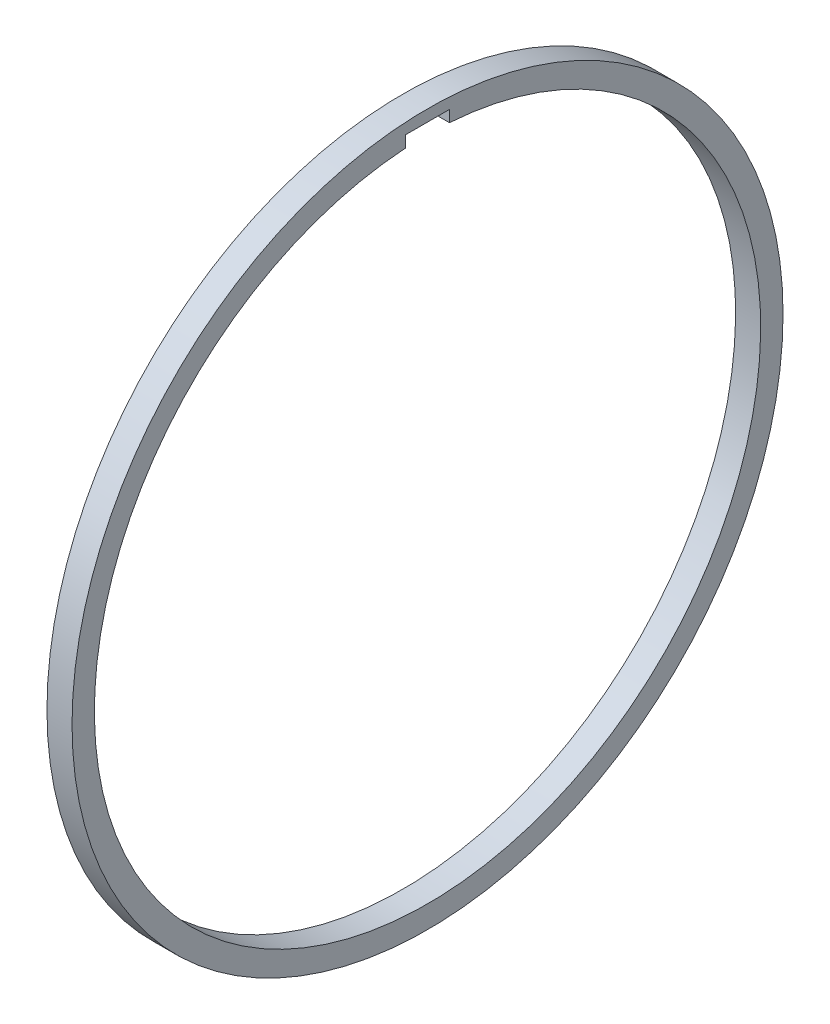
ISO-10303-21;
HEADER;
FILE_DESCRIPTION(('STEP AP214'),'2;1');
FILE_NAME('part.step','',(''),(''),'','','');
FILE_SCHEMA(('AUTOMOTIVE_DESIGN { 1 0 10303 214 1 1 1 1 }'));
ENDSEC;
DATA;
#1=APPLICATION_CONTEXT('core data for automotive mechanical design processes');
#2=APPLICATION_PROTOCOL_DEFINITION('international standard','automotive_design',2000,#1);
#3=PRODUCT_CONTEXT('',#1,'mechanical');
#4=PRODUCT('Part','Part','',(#3));
#5=PRODUCT_RELATED_PRODUCT_CATEGORY('part','',(#4));
#6=PRODUCT_DEFINITION_FORMATION('','',#4);
#7=PRODUCT_DEFINITION_CONTEXT('part definition',#1,'design');
#8=PRODUCT_DEFINITION('design','',#6,#7);
#9=PRODUCT_DEFINITION_SHAPE('','',#8);
#10=(LENGTH_UNIT() NAMED_UNIT(*) SI_UNIT(.MILLI.,.METRE.));
#11=(NAMED_UNIT(*) PLANE_ANGLE_UNIT() SI_UNIT($,.RADIAN.));
#12=(NAMED_UNIT(*) SI_UNIT($,.STERADIAN.) SOLID_ANGLE_UNIT());
#13=UNCERTAINTY_MEASURE_WITH_UNIT(LENGTH_MEASURE(1.E-05),#10,'distance_accuracy_value','');
#14=(GEOMETRIC_REPRESENTATION_CONTEXT(3) GLOBAL_UNCERTAINTY_ASSIGNED_CONTEXT((#13)) GLOBAL_UNIT_ASSIGNED_CONTEXT((#10,
#11,#12)) REPRESENTATION_CONTEXT('',''));
#15=CARTESIAN_POINT('',(0.,0.,0.));
#16=DIRECTION('',(0.,0.,1.));
#17=DIRECTION('',(1.,0.,0.));
#18=AXIS2_PLACEMENT_3D('',#15,#16,#17);
#19=CARTESIAN_POINT('',(-12.,0.,0.));
#20=DIRECTION('',(1.,0.,0.));
#21=DIRECTION('',(0.,0.,-1.));
#22=AXIS2_PLACEMENT_3D('',#19,#20,#21);
#23=CYLINDRICAL_SURFACE('',#22,170.2);
#24=CARTESIAN_POINT('',(-12.,0.,0.));
#25=DIRECTION('',(1.,0.,0.));
#26=DIRECTION('',(0.,0.,-1.));
#27=AXIS2_PLACEMENT_3D('',#24,#25,#26);
#28=CIRCLE('',#27,170.2);
#29=CARTESIAN_POINT('',(-12.,0.,-170.2));
#30=VERTEX_POINT('',#29);
#31=EDGE_CURVE('E11',#30,#30,#28,.T.);
#32=ORIENTED_EDGE('',*,*,#31,.T.);
#33=EDGE_LOOP('',(#32));
#34=FACE_BOUND('',#33,.T.);
#35=CARTESIAN_POINT('',(0.,0.,0.));
#36=DIRECTION('',(1.,0.,0.));
#37=DIRECTION('',(0.,0.,-1.));
#38=AXIS2_PLACEMENT_3D('',#35,#36,#37);
#39=CIRCLE('',#38,170.2);
#40=CARTESIAN_POINT('',(0.,0.,-170.2));
#41=VERTEX_POINT('',#40);
#42=EDGE_CURVE('E41',#41,#41,#39,.T.);
#43=ORIENTED_EDGE('',*,*,#42,.F.);
#44=EDGE_LOOP('',(#43));
#45=FACE_BOUND('',#44,.T.);
#46=ADVANCED_FACE('F38',(#34,#45),#23,.T.);
#47=CARTESIAN_POINT('',(-12.,0.,0.));
#48=DIRECTION('',(1.,0.,0.));
#49=DIRECTION('',(0.,0.,-1.));
#50=AXIS2_PLACEMENT_3D('',#47,#48,#49);
#51=PLANE('',#50);
#52=CARTESIAN_POINT('',(-12.,0.,0.));
#53=DIRECTION('',(1.,0.,0.));
#54=DIRECTION('',(0.,0.,-1.));
#55=AXIS2_PLACEMENT_3D('',#52,#53,#54);
#56=CIRCLE('',#55,159.5);
#57=CARTESIAN_POINT('',(-12.,159.154013458662,10.5));
#58=VERTEX_POINT('',#57);
#59=CARTESIAN_POINT('',(-12.,159.154013458662,-10.5));
#60=VERTEX_POINT('',#59);
#61=EDGE_CURVE('E123',#58,#60,#56,.T.);
#62=ORIENTED_EDGE('',*,*,#61,.T.);
#63=DIRECTION('',(0.,1.,0.));
#64=VECTOR('',#63,1.);
#65=CARTESIAN_POINT('',(-12.,159.154013458662,-10.5));
#66=LINE('',#65,#64);
#67=CARTESIAN_POINT('',(-12.,164.654013458662,-10.5));
#68=VERTEX_POINT('',#67);
#69=EDGE_CURVE('E62',#60,#68,#66,.T.);
#70=ORIENTED_EDGE('',*,*,#69,.T.);
#71=DIRECTION('',(0.,0.,1.));
#72=VECTOR('',#71,1.);
#73=CARTESIAN_POINT('',(-12.,164.654013458662,10.5));
#74=LINE('',#73,#72);
#75=CARTESIAN_POINT('',(-12.,164.654013458662,10.5));
#76=VERTEX_POINT('',#75);
#77=EDGE_CURVE('E87',#68,#76,#74,.T.);
#78=ORIENTED_EDGE('',*,*,#77,.T.);
#79=DIRECTION('',(0.,-1.,0.));
#80=VECTOR('',#79,1.);
#81=CARTESIAN_POINT('',(-12.,159.154013458662,10.5));
#82=LINE('',#81,#80);
#83=EDGE_CURVE('E94',#76,#58,#82,.T.);
#84=ORIENTED_EDGE('',*,*,#83,.T.);
#85=EDGE_LOOP('',(#62,#70,#78,#84));
#86=FACE_BOUND('',#85,.T.);
#87=ORIENTED_EDGE('',*,*,#31,.F.);
#88=EDGE_LOOP('',(#87));
#89=FACE_BOUND('',#88,.T.);
#90=ADVANCED_FACE('F101',(#86,#89),#51,.F.);
#91=CARTESIAN_POINT('',(0.,0.,0.));
#92=DIRECTION('',(1.,0.,0.));
#93=DIRECTION('',(0.,0.,-1.));
#94=AXIS2_PLACEMENT_3D('',#91,#92,#93);
#95=PLANE('',#94);
#96=DIRECTION('',(0.,1.,0.));
#97=VECTOR('',#96,1.);
#98=CARTESIAN_POINT('',(0.,159.154013458662,-10.5));
#99=LINE('',#98,#97);
#100=CARTESIAN_POINT('',(0.,159.154013458662,-10.5));
#101=VERTEX_POINT('',#100);
#102=CARTESIAN_POINT('',(0.,164.654013458662,-10.5));
#103=VERTEX_POINT('',#102);
#104=EDGE_CURVE('E109',#101,#103,#99,.T.);
#105=ORIENTED_EDGE('',*,*,#104,.F.);
#106=CARTESIAN_POINT('',(0.,0.,0.));
#107=DIRECTION('',(1.,0.,0.));
#108=DIRECTION('',(0.,0.,-1.));
#109=AXIS2_PLACEMENT_3D('',#106,#107,#108);
#110=CIRCLE('',#109,159.5);
#111=CARTESIAN_POINT('',(0.,159.154013458662,10.5));
#112=VERTEX_POINT('',#111);
#113=EDGE_CURVE('E118',#112,#101,#110,.T.);
#114=ORIENTED_EDGE('',*,*,#113,.F.);
#115=DIRECTION('',(0.,-1.,0.));
#116=VECTOR('',#115,1.);
#117=CARTESIAN_POINT('',(0.,159.154013458662,10.5));
#118=LINE('',#117,#116);
#119=CARTESIAN_POINT('',(0.,164.654013458662,10.5));
#120=VERTEX_POINT('',#119);
#121=EDGE_CURVE('E53',#120,#112,#118,.T.);
#122=ORIENTED_EDGE('',*,*,#121,.F.);
#123=DIRECTION('',(0.,0.,1.));
#124=VECTOR('',#123,1.);
#125=CARTESIAN_POINT('',(0.,164.654013458662,10.5));
#126=LINE('',#125,#124);
#127=EDGE_CURVE('E89',#103,#120,#126,.T.);
#128=ORIENTED_EDGE('',*,*,#127,.F.);
#129=EDGE_LOOP('',(#105,#114,#122,#128));
#130=FACE_BOUND('',#129,.T.);
#131=ORIENTED_EDGE('',*,*,#42,.T.);
#132=EDGE_LOOP('',(#131));
#133=FACE_BOUND('',#132,.T.);
#134=ADVANCED_FACE('F134',(#130,#133),#95,.T.);
#135=CARTESIAN_POINT('',(-12.,0.,0.));
#136=DIRECTION('',(1.,0.,0.));
#137=DIRECTION('',(0.,0.,-1.));
#138=AXIS2_PLACEMENT_3D('',#135,#136,#137);
#139=CYLINDRICAL_SURFACE('',#138,159.5);
#140=ORIENTED_EDGE('',*,*,#113,.T.);
#141=DIRECTION('',(1.,0.,0.));
#142=VECTOR('',#141,1.);
#143=CARTESIAN_POINT('',(-12.,159.154013458662,-10.5));
#144=LINE('',#143,#142);
#145=EDGE_CURVE('E75',#60,#101,#144,.T.);
#146=ORIENTED_EDGE('',*,*,#145,.F.);
#147=ORIENTED_EDGE('',*,*,#61,.F.);
#148=DIRECTION('',(1.,0.,0.));
#149=VECTOR('',#148,1.);
#150=CARTESIAN_POINT('',(-12.,159.154013458662,10.5));
#151=LINE('',#150,#149);
#152=EDGE_CURVE('E91',#58,#112,#151,.T.);
#153=ORIENTED_EDGE('',*,*,#152,.T.);
#154=EDGE_LOOP('',(#140,#146,#147,#153));
#155=FACE_BOUND('',#154,.T.);
#156=ADVANCED_FACE('F132',(#155),#139,.F.);
#157=CARTESIAN_POINT('',(-12.,159.154013458662,-10.5));
#158=DIRECTION('',(0.,0.,-1.));
#159=DIRECTION('',(-1.,0.,0.));
#160=AXIS2_PLACEMENT_3D('',#157,#158,#159);
#161=PLANE('',#160);
#162=ORIENTED_EDGE('',*,*,#104,.T.);
#163=DIRECTION('',(1.,0.,0.));
#164=VECTOR('',#163,1.);
#165=CARTESIAN_POINT('',(-12.,164.654013458662,-10.5));
#166=LINE('',#165,#164);
#167=EDGE_CURVE('E78',#68,#103,#166,.T.);
#168=ORIENTED_EDGE('',*,*,#167,.F.);
#169=ORIENTED_EDGE('',*,*,#69,.F.);
#170=ORIENTED_EDGE('',*,*,#145,.T.);
#171=EDGE_LOOP('',(#162,#168,#169,#170));
#172=FACE_BOUND('',#171,.T.);
#173=ADVANCED_FACE('F136',(#172),#161,.F.);
#174=CARTESIAN_POINT('',(-12.,159.154013458662,10.5));
#175=DIRECTION('',(0.,0.,1.));
#176=DIRECTION('',(1.,0.,0.));
#177=AXIS2_PLACEMENT_3D('',#174,#175,#176);
#178=PLANE('',#177);
#179=ORIENTED_EDGE('',*,*,#121,.T.);
#180=ORIENTED_EDGE('',*,*,#152,.F.);
#181=ORIENTED_EDGE('',*,*,#83,.F.);
#182=DIRECTION('',(1.,0.,0.));
#183=VECTOR('',#182,1.);
#184=CARTESIAN_POINT('',(-12.,164.654013458662,10.5));
#185=LINE('',#184,#183);
#186=EDGE_CURVE('E83',#76,#120,#185,.T.);
#187=ORIENTED_EDGE('',*,*,#186,.T.);
#188=EDGE_LOOP('',(#179,#180,#181,#187));
#189=FACE_BOUND('',#188,.T.);
#190=ADVANCED_FACE('F95',(#189),#178,.F.);
#191=CARTESIAN_POINT('',(-12.,164.654013458662,10.5));
#192=DIRECTION('',(0.,1.,0.));
#193=DIRECTION('',(0.,0.,1.));
#194=AXIS2_PLACEMENT_3D('',#191,#192,#193);
#195=PLANE('',#194);
#196=ORIENTED_EDGE('',*,*,#127,.T.);
#197=ORIENTED_EDGE('',*,*,#186,.F.);
#198=ORIENTED_EDGE('',*,*,#77,.F.);
#199=ORIENTED_EDGE('',*,*,#167,.T.);
#200=EDGE_LOOP('',(#196,#197,#198,#199));
#201=FACE_BOUND('',#200,.T.);
#202=ADVANCED_FACE('F85',(#201),#195,.F.);
#203=CLOSED_SHELL('',(#46,#90,#134,#156,#173,#190,#202));
#204=MANIFOLD_SOLID_BREP('B2',#203);
#205=ADVANCED_BREP_SHAPE_REPRESENTATION('',(#18,#204),#14);
#206=SHAPE_DEFINITION_REPRESENTATION(#9,#205);
ENDSEC;
END-ISO-10303-21;
